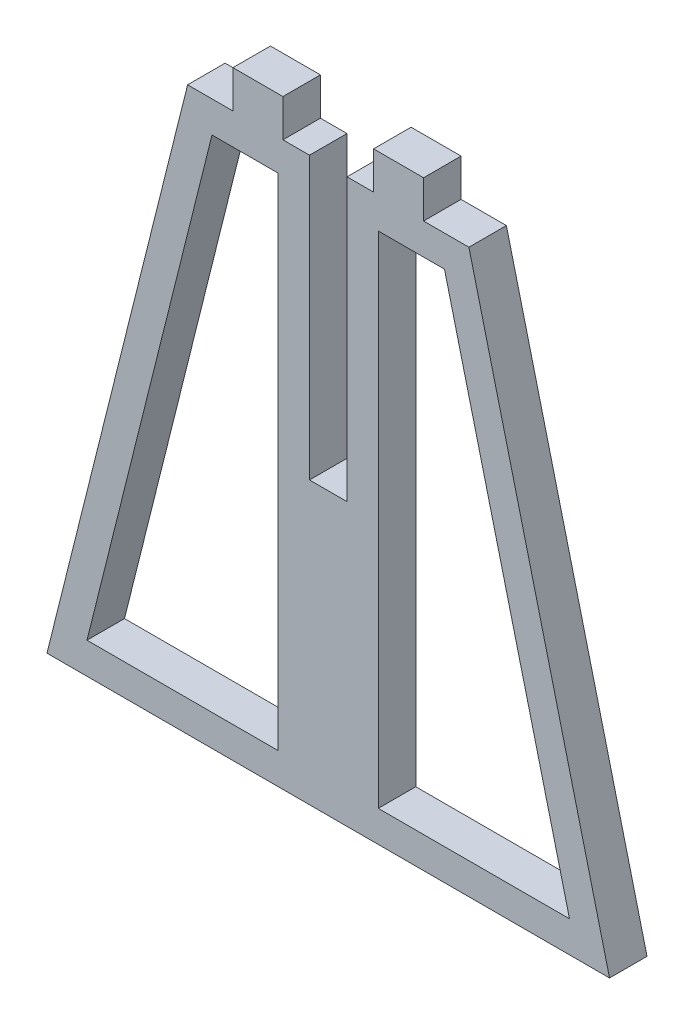
ISO-10303-21;
HEADER;
FILE_DESCRIPTION(('STEP AP214'),'2;1');
FILE_NAME('part.step','',(''),(''),'','','');
FILE_SCHEMA(('AUTOMOTIVE_DESIGN { 1 0 10303 214 1 1 1 1 }'));
ENDSEC;
DATA;
#1=APPLICATION_CONTEXT('core data for automotive mechanical design processes');
#2=APPLICATION_PROTOCOL_DEFINITION('international standard','automotive_design',2000,#1);
#3=PRODUCT_CONTEXT('',#1,'mechanical');
#4=PRODUCT('Part','Part','',(#3));
#5=PRODUCT_RELATED_PRODUCT_CATEGORY('part','',(#4));
#6=PRODUCT_DEFINITION_FORMATION('','',#4);
#7=PRODUCT_DEFINITION_CONTEXT('part definition',#1,'design');
#8=PRODUCT_DEFINITION('design','',#6,#7);
#9=PRODUCT_DEFINITION_SHAPE('','',#8);
#10=(LENGTH_UNIT() NAMED_UNIT(*) SI_UNIT(.MILLI.,.METRE.));
#11=(NAMED_UNIT(*) PLANE_ANGLE_UNIT() SI_UNIT($,.RADIAN.));
#12=(NAMED_UNIT(*) SI_UNIT($,.STERADIAN.) SOLID_ANGLE_UNIT());
#13=UNCERTAINTY_MEASURE_WITH_UNIT(LENGTH_MEASURE(1.E-05),#10,'distance_accuracy_value','');
#14=(GEOMETRIC_REPRESENTATION_CONTEXT(3) GLOBAL_UNCERTAINTY_ASSIGNED_CONTEXT((#13)) GLOBAL_UNIT_ASSIGNED_CONTEXT((#10,
#11,#12)) REPRESENTATION_CONTEXT('',''));
#15=CARTESIAN_POINT('',(0.,0.,0.));
#16=DIRECTION('',(0.,0.,1.));
#17=DIRECTION('',(1.,0.,0.));
#18=AXIS2_PLACEMENT_3D('',#15,#16,#17);
#19=CARTESIAN_POINT('',(0.,0.,6.));
#20=DIRECTION('',(0.,0.,-1.));
#21=DIRECTION('',(-1.,0.,0.));
#22=AXIS2_PLACEMENT_3D('',#19,#20,#21);
#23=PLANE('',#22);
#24=DIRECTION('',(0.,1.,0.));
#25=VECTOR('',#24,1.);
#26=CARTESIAN_POINT('',(-8.,20.6339866017632,6.));
#27=LINE('',#26,#25);
#28=CARTESIAN_POINT('',(-8.,20.6339866017632,6.));
#29=VERTEX_POINT('',#28);
#30=CARTESIAN_POINT('',(-8.,100.633986601763,6.));
#31=VERTEX_POINT('',#30);
#32=EDGE_CURVE('E230',#29,#31,#27,.T.);
#33=ORIENTED_EDGE('',*,*,#32,.F.);
#34=DIRECTION('',(1.,0.,0.));
#35=VECTOR('',#34,1.);
#36=CARTESIAN_POINT('',(-38.5961179679779,20.6339866017632,6.));
#37=LINE('',#36,#35);
#38=CARTESIAN_POINT('',(-38.5961179679779,20.6339866017632,6.));
#39=VERTEX_POINT('',#38);
#40=EDGE_CURVE('E238',#39,#29,#37,.T.);
#41=ORIENTED_EDGE('',*,*,#40,.F.);
#42=DIRECTION('',(-0.242535625036333,-0.970142500145332,0.));
#43=VECTOR('',#42,1.);
#44=CARTESIAN_POINT('',(-18.5961179679779,100.633986601763,6.));
#45=LINE('',#44,#43);
#46=CARTESIAN_POINT('',(-18.5961179679779,100.633986601763,6.));
#47=VERTEX_POINT('',#46);
#48=EDGE_CURVE('E235',#47,#39,#45,.T.);
#49=ORIENTED_EDGE('',*,*,#48,.F.);
#50=DIRECTION('',(-1.,0.,0.));
#51=VECTOR('',#50,1.);
#52=CARTESIAN_POINT('',(-8.,100.633986601763,6.));
#53=LINE('',#52,#51);
#54=EDGE_CURVE('E232',#31,#47,#53,.T.);
#55=ORIENTED_EDGE('',*,*,#54,.F.);
#56=EDGE_LOOP('',(#33,#41,#49,#55));
#57=FACE_BOUND('',#56,.T.);
#58=DIRECTION('',(-0.242535625036333,0.970142500145332,0.));
#59=VECTOR('',#58,1.);
#60=CARTESIAN_POINT('',(22.5,105.633986601763,6.));
#61=LINE('',#60,#59);
#62=CARTESIAN_POINT('',(45.,15.6339866017632,6.));
#63=VERTEX_POINT('',#62);
#64=CARTESIAN_POINT('',(22.5,105.633986601763,6.));
#65=VERTEX_POINT('',#64);
#66=EDGE_CURVE('E261',#63,#65,#61,.T.);
#67=ORIENTED_EDGE('',*,*,#66,.T.);
#68=DIRECTION('',(-1.,0.,0.));
#69=VECTOR('',#68,1.);
#70=CARTESIAN_POINT('',(15.25,105.633986601763,6.));
#71=LINE('',#70,#69);
#72=CARTESIAN_POINT('',(15.25,105.633986601763,6.));
#73=VERTEX_POINT('',#72);
#74=EDGE_CURVE('E264',#65,#73,#71,.T.);
#75=ORIENTED_EDGE('',*,*,#74,.T.);
#76=DIRECTION('',(0.,1.,0.));
#77=VECTOR('',#76,1.);
#78=CARTESIAN_POINT('',(15.25,105.633986601763,6.));
#79=LINE('',#78,#77);
#80=CARTESIAN_POINT('',(15.25,111.633986601763,6.));
#81=VERTEX_POINT('',#80);
#82=EDGE_CURVE('E267',#73,#81,#79,.T.);
#83=ORIENTED_EDGE('',*,*,#82,.T.);
#84=DIRECTION('',(-1.,0.,0.));
#85=VECTOR('',#84,1.);
#86=CARTESIAN_POINT('',(7.25,111.633986601763,6.));
#87=LINE('',#86,#85);
#88=CARTESIAN_POINT('',(7.25,111.633986601763,6.));
#89=VERTEX_POINT('',#88);
#90=EDGE_CURVE('E269',#81,#89,#87,.T.);
#91=ORIENTED_EDGE('',*,*,#90,.T.);
#92=DIRECTION('',(0.,-1.,0.));
#93=VECTOR('',#92,1.);
#94=CARTESIAN_POINT('',(7.25,105.633986601763,6.));
#95=LINE('',#94,#93);
#96=CARTESIAN_POINT('',(7.25,105.633986601763,6.));
#97=VERTEX_POINT('',#96);
#98=EDGE_CURVE('E271',#89,#97,#95,.T.);
#99=ORIENTED_EDGE('',*,*,#98,.T.);
#100=DIRECTION('',(-1.,0.,0.));
#101=VECTOR('',#100,1.);
#102=CARTESIAN_POINT('',(3.,105.633986601763,6.));
#103=LINE('',#102,#101);
#104=CARTESIAN_POINT('',(3.,105.633986601763,6.));
#105=VERTEX_POINT('',#104);
#106=EDGE_CURVE('E273',#97,#105,#103,.T.);
#107=ORIENTED_EDGE('',*,*,#106,.T.);
#108=DIRECTION('',(0.,-1.,0.));
#109=VECTOR('',#108,1.);
#110=CARTESIAN_POINT('',(3.,105.633986601763,6.));
#111=LINE('',#110,#109);
#112=CARTESIAN_POINT('',(3.,60.6339866017632,6.));
#113=VERTEX_POINT('',#112);
#114=EDGE_CURVE('E275',#105,#113,#111,.T.);
#115=ORIENTED_EDGE('',*,*,#114,.T.);
#116=DIRECTION('',(-1.,0.,0.));
#117=VECTOR('',#116,1.);
#118=CARTESIAN_POINT('',(-3.,60.6339866017632,6.));
#119=LINE('',#118,#117);
#120=CARTESIAN_POINT('',(-3.,60.6339866017632,6.));
#121=VERTEX_POINT('',#120);
#122=EDGE_CURVE('E277',#113,#121,#119,.T.);
#123=ORIENTED_EDGE('',*,*,#122,.T.);
#124=DIRECTION('',(0.,1.,0.));
#125=VECTOR('',#124,1.);
#126=CARTESIAN_POINT('',(-3.,105.633986601763,6.));
#127=LINE('',#126,#125);
#128=CARTESIAN_POINT('',(-3.,105.633986601763,6.));
#129=VERTEX_POINT('',#128);
#130=EDGE_CURVE('E279',#121,#129,#127,.T.);
#131=ORIENTED_EDGE('',*,*,#130,.T.);
#132=DIRECTION('',(-1.,0.,0.));
#133=VECTOR('',#132,1.);
#134=CARTESIAN_POINT('',(-7.25,105.633986601763,6.));
#135=LINE('',#134,#133);
#136=CARTESIAN_POINT('',(-7.25,105.633986601763,6.));
#137=VERTEX_POINT('',#136);
#138=EDGE_CURVE('E281',#129,#137,#135,.T.);
#139=ORIENTED_EDGE('',*,*,#138,.T.);
#140=DIRECTION('',(0.,1.,0.));
#141=VECTOR('',#140,1.);
#142=CARTESIAN_POINT('',(-7.25,105.633986601763,6.));
#143=LINE('',#142,#141);
#144=CARTESIAN_POINT('',(-7.25,111.633986601763,6.));
#145=VERTEX_POINT('',#144);
#146=EDGE_CURVE('E283',#137,#145,#143,.T.);
#147=ORIENTED_EDGE('',*,*,#146,.T.);
#148=DIRECTION('',(-1.,0.,0.));
#149=VECTOR('',#148,1.);
#150=CARTESIAN_POINT('',(-7.25,111.633986601763,6.));
#151=LINE('',#150,#149);
#152=CARTESIAN_POINT('',(-15.25,111.633986601763,6.));
#153=VERTEX_POINT('',#152);
#154=EDGE_CURVE('E285',#145,#153,#151,.T.);
#155=ORIENTED_EDGE('',*,*,#154,.T.);
#156=DIRECTION('',(0.,-1.,0.));
#157=VECTOR('',#156,1.);
#158=CARTESIAN_POINT('',(-15.25,105.633986601763,6.));
#159=LINE('',#158,#157);
#160=CARTESIAN_POINT('',(-15.25,105.633986601763,6.));
#161=VERTEX_POINT('',#160);
#162=EDGE_CURVE('E287',#153,#161,#159,.T.);
#163=ORIENTED_EDGE('',*,*,#162,.T.);
#164=DIRECTION('',(-1.,0.,0.));
#165=VECTOR('',#164,1.);
#166=CARTESIAN_POINT('',(-22.5,105.633986601763,6.));
#167=LINE('',#166,#165);
#168=CARTESIAN_POINT('',(-22.5,105.633986601763,6.));
#169=VERTEX_POINT('',#168);
#170=EDGE_CURVE('E289',#161,#169,#167,.T.);
#171=ORIENTED_EDGE('',*,*,#170,.T.);
#172=DIRECTION('',(-0.242535625036333,-0.970142500145332,0.));
#173=VECTOR('',#172,1.);
#174=CARTESIAN_POINT('',(-45.,15.6339866017632,6.));
#175=LINE('',#174,#173);
#176=CARTESIAN_POINT('',(-45.,15.6339866017632,6.));
#177=VERTEX_POINT('',#176);
#178=EDGE_CURVE('E291',#169,#177,#175,.T.);
#179=ORIENTED_EDGE('',*,*,#178,.T.);
#180=DIRECTION('',(1.,0.,0.));
#181=VECTOR('',#180,1.);
#182=CARTESIAN_POINT('',(45.,15.6339866017632,6.));
#183=LINE('',#182,#181);
#184=EDGE_CURVE('E293',#177,#63,#183,.T.);
#185=ORIENTED_EDGE('',*,*,#184,.T.);
#186=EDGE_LOOP('',(#67,#75,#83,#91,#99,#107,#115,#123,#131,#139,#147,#155,#163,#171,#179,#185));
#187=FACE_BOUND('',#186,.T.);
#188=DIRECTION('',(-0.242535625036333,0.970142500145332,0.));
#189=VECTOR('',#188,1.);
#190=CARTESIAN_POINT('',(18.5961179679779,100.633986601763,6.));
#191=LINE('',#190,#189);
#192=CARTESIAN_POINT('',(38.5961179679779,20.6339866017632,6.));
#193=VERTEX_POINT('',#192);
#194=CARTESIAN_POINT('',(18.5961179679779,100.633986601763,6.));
#195=VERTEX_POINT('',#194);
#196=EDGE_CURVE('E194',#193,#195,#191,.T.);
#197=ORIENTED_EDGE('',*,*,#196,.F.);
#198=DIRECTION('',(1.,0.,0.));
#199=VECTOR('',#198,1.);
#200=CARTESIAN_POINT('',(38.5961179679779,20.6339866017632,6.));
#201=LINE('',#200,#199);
#202=CARTESIAN_POINT('',(8.,20.6339866017632,6.));
#203=VERTEX_POINT('',#202);
#204=EDGE_CURVE('E216',#203,#193,#201,.T.);
#205=ORIENTED_EDGE('',*,*,#204,.F.);
#206=DIRECTION('',(0.,-1.,0.));
#207=VECTOR('',#206,1.);
#208=CARTESIAN_POINT('',(8.,20.6339866017632,6.));
#209=LINE('',#208,#207);
#210=CARTESIAN_POINT('',(8.,100.633986601763,6.));
#211=VERTEX_POINT('',#210);
#212=EDGE_CURVE('E214',#211,#203,#209,.T.);
#213=ORIENTED_EDGE('',*,*,#212,.F.);
#214=DIRECTION('',(-1.,0.,0.));
#215=VECTOR('',#214,1.);
#216=CARTESIAN_POINT('',(8.,100.633986601763,6.));
#217=LINE('',#216,#215);
#218=EDGE_CURVE('E202',#195,#211,#217,.T.);
#219=ORIENTED_EDGE('',*,*,#218,.F.);
#220=EDGE_LOOP('',(#197,#205,#213,#219));
#221=FACE_BOUND('',#220,.T.);
#222=ADVANCED_FACE('F33',(#57,#187,#221),#23,.F.);
#223=CARTESIAN_POINT('',(0.,0.,0.));
#224=DIRECTION('',(0.,0.,-1.));
#225=DIRECTION('',(-1.,0.,0.));
#226=AXIS2_PLACEMENT_3D('',#223,#224,#225);
#227=PLANE('',#226);
#228=DIRECTION('',(-0.242535625036333,0.970142500145332,0.));
#229=VECTOR('',#228,1.);
#230=CARTESIAN_POINT('',(22.5,105.633986601763,0.));
#231=LINE('',#230,#229);
#232=CARTESIAN_POINT('',(45.,15.6339866017632,0.));
#233=VERTEX_POINT('',#232);
#234=CARTESIAN_POINT('',(22.5,105.633986601763,0.));
#235=VERTEX_POINT('',#234);
#236=EDGE_CURVE('E260',#233,#235,#231,.T.);
#237=ORIENTED_EDGE('',*,*,#236,.F.);
#238=DIRECTION('',(1.,0.,0.));
#239=VECTOR('',#238,1.);
#240=CARTESIAN_POINT('',(45.,15.6339866017632,0.));
#241=LINE('',#240,#239);
#242=CARTESIAN_POINT('',(-45.,15.6339866017632,0.));
#243=VERTEX_POINT('',#242);
#244=EDGE_CURVE('E265',#243,#233,#241,.T.);
#245=ORIENTED_EDGE('',*,*,#244,.F.);
#246=DIRECTION('',(-0.242535625036333,-0.970142500145332,0.));
#247=VECTOR('',#246,1.);
#248=CARTESIAN_POINT('',(-45.,15.6339866017632,0.));
#249=LINE('',#248,#247);
#250=CARTESIAN_POINT('',(-22.5,105.633986601763,0.));
#251=VERTEX_POINT('',#250);
#252=EDGE_CURVE('E324',#251,#243,#249,.T.);
#253=ORIENTED_EDGE('',*,*,#252,.F.);
#254=DIRECTION('',(-1.,0.,0.));
#255=VECTOR('',#254,1.);
#256=CARTESIAN_POINT('',(-22.5,105.633986601763,0.));
#257=LINE('',#256,#255);
#258=CARTESIAN_POINT('',(-15.25,105.633986601763,0.));
#259=VERTEX_POINT('',#258);
#260=EDGE_CURVE('E322',#259,#251,#257,.T.);
#261=ORIENTED_EDGE('',*,*,#260,.F.);
#262=DIRECTION('',(0.,-1.,0.));
#263=VECTOR('',#262,1.);
#264=CARTESIAN_POINT('',(-15.25,105.633986601763,0.));
#265=LINE('',#264,#263);
#266=CARTESIAN_POINT('',(-15.25,111.633986601763,0.));
#267=VERTEX_POINT('',#266);
#268=EDGE_CURVE('E320',#267,#259,#265,.T.);
#269=ORIENTED_EDGE('',*,*,#268,.F.);
#270=DIRECTION('',(-1.,0.,0.));
#271=VECTOR('',#270,1.);
#272=CARTESIAN_POINT('',(-7.25,111.633986601763,0.));
#273=LINE('',#272,#271);
#274=CARTESIAN_POINT('',(-7.25,111.633986601763,0.));
#275=VERTEX_POINT('',#274);
#276=EDGE_CURVE('E318',#275,#267,#273,.T.);
#277=ORIENTED_EDGE('',*,*,#276,.F.);
#278=DIRECTION('',(0.,1.,0.));
#279=VECTOR('',#278,1.);
#280=CARTESIAN_POINT('',(-7.25,105.633986601763,0.));
#281=LINE('',#280,#279);
#282=CARTESIAN_POINT('',(-7.25,105.633986601763,0.));
#283=VERTEX_POINT('',#282);
#284=EDGE_CURVE('E316',#283,#275,#281,.T.);
#285=ORIENTED_EDGE('',*,*,#284,.F.);
#286=DIRECTION('',(-1.,0.,0.));
#287=VECTOR('',#286,1.);
#288=CARTESIAN_POINT('',(-7.25,105.633986601763,0.));
#289=LINE('',#288,#287);
#290=CARTESIAN_POINT('',(-3.,105.633986601763,0.));
#291=VERTEX_POINT('',#290);
#292=EDGE_CURVE('E314',#291,#283,#289,.T.);
#293=ORIENTED_EDGE('',*,*,#292,.F.);
#294=DIRECTION('',(0.,1.,0.));
#295=VECTOR('',#294,1.);
#296=CARTESIAN_POINT('',(-3.,105.633986601763,0.));
#297=LINE('',#296,#295);
#298=CARTESIAN_POINT('',(-3.,60.6339866017632,0.));
#299=VERTEX_POINT('',#298);
#300=EDGE_CURVE('E312',#299,#291,#297,.T.);
#301=ORIENTED_EDGE('',*,*,#300,.F.);
#302=DIRECTION('',(-1.,0.,0.));
#303=VECTOR('',#302,1.);
#304=CARTESIAN_POINT('',(-3.,60.6339866017632,0.));
#305=LINE('',#304,#303);
#306=CARTESIAN_POINT('',(3.,60.6339866017632,0.));
#307=VERTEX_POINT('',#306);
#308=EDGE_CURVE('E310',#307,#299,#305,.T.);
#309=ORIENTED_EDGE('',*,*,#308,.F.);
#310=DIRECTION('',(0.,-1.,0.));
#311=VECTOR('',#310,1.);
#312=CARTESIAN_POINT('',(3.,105.633986601763,0.));
#313=LINE('',#312,#311);
#314=CARTESIAN_POINT('',(3.,105.633986601763,0.));
#315=VERTEX_POINT('',#314);
#316=EDGE_CURVE('E308',#315,#307,#313,.T.);
#317=ORIENTED_EDGE('',*,*,#316,.F.);
#318=DIRECTION('',(-1.,0.,0.));
#319=VECTOR('',#318,1.);
#320=CARTESIAN_POINT('',(3.,105.633986601763,0.));
#321=LINE('',#320,#319);
#322=CARTESIAN_POINT('',(7.25,105.633986601763,0.));
#323=VERTEX_POINT('',#322);
#324=EDGE_CURVE('E306',#323,#315,#321,.T.);
#325=ORIENTED_EDGE('',*,*,#324,.F.);
#326=DIRECTION('',(0.,-1.,0.));
#327=VECTOR('',#326,1.);
#328=CARTESIAN_POINT('',(7.25,105.633986601763,0.));
#329=LINE('',#328,#327);
#330=CARTESIAN_POINT('',(7.25,111.633986601763,0.));
#331=VERTEX_POINT('',#330);
#332=EDGE_CURVE('E304',#331,#323,#329,.T.);
#333=ORIENTED_EDGE('',*,*,#332,.F.);
#334=DIRECTION('',(-1.,0.,0.));
#335=VECTOR('',#334,1.);
#336=CARTESIAN_POINT('',(7.25,111.633986601763,0.));
#337=LINE('',#336,#335);
#338=CARTESIAN_POINT('',(15.25,111.633986601763,0.));
#339=VERTEX_POINT('',#338);
#340=EDGE_CURVE('E302',#339,#331,#337,.T.);
#341=ORIENTED_EDGE('',*,*,#340,.F.);
#342=DIRECTION('',(0.,1.,0.));
#343=VECTOR('',#342,1.);
#344=CARTESIAN_POINT('',(15.25,105.633986601763,0.));
#345=LINE('',#344,#343);
#346=CARTESIAN_POINT('',(15.25,105.633986601763,0.));
#347=VERTEX_POINT('',#346);
#348=EDGE_CURVE('E300',#347,#339,#345,.T.);
#349=ORIENTED_EDGE('',*,*,#348,.F.);
#350=DIRECTION('',(-1.,0.,0.));
#351=VECTOR('',#350,1.);
#352=CARTESIAN_POINT('',(15.25,105.633986601763,0.));
#353=LINE('',#352,#351);
#354=EDGE_CURVE('E298',#235,#347,#353,.T.);
#355=ORIENTED_EDGE('',*,*,#354,.F.);
#356=EDGE_LOOP('',(#237,#245,#253,#261,#269,#277,#285,#293,#301,#309,#317,#325,#333,#341,#349,#355));
#357=FACE_BOUND('',#356,.T.);
#358=DIRECTION('',(1.,0.,0.));
#359=VECTOR('',#358,1.);
#360=CARTESIAN_POINT('',(-38.5961179679779,20.6339866017632,0.));
#361=LINE('',#360,#359);
#362=CARTESIAN_POINT('',(-38.5961179679779,20.6339866017632,0.));
#363=VERTEX_POINT('',#362);
#364=CARTESIAN_POINT('',(-8.,20.6339866017632,0.));
#365=VERTEX_POINT('',#364);
#366=EDGE_CURVE('E233',#363,#365,#361,.T.);
#367=ORIENTED_EDGE('',*,*,#366,.T.);
#368=DIRECTION('',(0.,1.,0.));
#369=VECTOR('',#368,1.);
#370=CARTESIAN_POINT('',(-8.,20.6339866017632,0.));
#371=LINE('',#370,#369);
#372=CARTESIAN_POINT('',(-8.,100.633986601763,0.));
#373=VERTEX_POINT('',#372);
#374=EDGE_CURVE('E210',#365,#373,#371,.T.);
#375=ORIENTED_EDGE('',*,*,#374,.T.);
#376=DIRECTION('',(-1.,0.,0.));
#377=VECTOR('',#376,1.);
#378=CARTESIAN_POINT('',(-8.,100.633986601763,0.));
#379=LINE('',#378,#377);
#380=CARTESIAN_POINT('',(-18.5961179679779,100.633986601763,0.));
#381=VERTEX_POINT('',#380);
#382=EDGE_CURVE('E243',#373,#381,#379,.T.);
#383=ORIENTED_EDGE('',*,*,#382,.T.);
#384=DIRECTION('',(-0.242535625036333,-0.970142500145332,0.));
#385=VECTOR('',#384,1.);
#386=CARTESIAN_POINT('',(-18.5961179679779,100.633986601763,0.));
#387=LINE('',#386,#385);
#388=EDGE_CURVE('E246',#381,#363,#387,.T.);
#389=ORIENTED_EDGE('',*,*,#388,.T.);
#390=EDGE_LOOP('',(#367,#375,#383,#389));
#391=FACE_BOUND('',#390,.T.);
#392=DIRECTION('',(1.,0.,0.));
#393=VECTOR('',#392,1.);
#394=CARTESIAN_POINT('',(38.5961179679779,20.6339866017632,0.));
#395=LINE('',#394,#393);
#396=CARTESIAN_POINT('',(8.,20.6339866017632,0.));
#397=VERTEX_POINT('',#396);
#398=CARTESIAN_POINT('',(38.5961179679779,20.6339866017632,0.));
#399=VERTEX_POINT('',#398);
#400=EDGE_CURVE('E203',#397,#399,#395,.T.);
#401=ORIENTED_EDGE('',*,*,#400,.T.);
#402=DIRECTION('',(-0.242535625036333,0.970142500145332,0.));
#403=VECTOR('',#402,1.);
#404=CARTESIAN_POINT('',(18.5961179679779,100.633986601763,0.));
#405=LINE('',#404,#403);
#406=CARTESIAN_POINT('',(18.5961179679779,100.633986601763,0.));
#407=VERTEX_POINT('',#406);
#408=EDGE_CURVE('E56',#399,#407,#405,.T.);
#409=ORIENTED_EDGE('',*,*,#408,.T.);
#410=DIRECTION('',(-1.,0.,0.));
#411=VECTOR('',#410,1.);
#412=CARTESIAN_POINT('',(8.,100.633986601763,0.));
#413=LINE('',#412,#411);
#414=CARTESIAN_POINT('',(8.,100.633986601763,0.));
#415=VERTEX_POINT('',#414);
#416=EDGE_CURVE('E209',#407,#415,#413,.T.);
#417=ORIENTED_EDGE('',*,*,#416,.T.);
#418=DIRECTION('',(0.,-1.,0.));
#419=VECTOR('',#418,1.);
#420=CARTESIAN_POINT('',(8.,20.6339866017632,0.));
#421=LINE('',#420,#419);
#422=EDGE_CURVE('E222',#415,#397,#421,.T.);
#423=ORIENTED_EDGE('',*,*,#422,.T.);
#424=EDGE_LOOP('',(#401,#409,#417,#423));
#425=FACE_BOUND('',#424,.T.);
#426=ADVANCED_FACE('F378',(#357,#391,#425),#227,.T.);
#427=CARTESIAN_POINT('',(22.5,105.633986601763,6.));
#428=DIRECTION('',(-0.970142500145332,-0.242535625036333,0.));
#429=DIRECTION('',(0.242535625036333,-0.970142500145332,0.));
#430=AXIS2_PLACEMENT_3D('',#427,#428,#429);
#431=PLANE('',#430);
#432=ORIENTED_EDGE('',*,*,#236,.T.);
#433=DIRECTION('',(0.,0.,-1.));
#434=VECTOR('',#433,1.);
#435=CARTESIAN_POINT('',(22.5,105.633986601763,6.));
#436=LINE('',#435,#434);
#437=EDGE_CURVE('E11',#65,#235,#436,.T.);
#438=ORIENTED_EDGE('',*,*,#437,.F.);
#439=ORIENTED_EDGE('',*,*,#66,.F.);
#440=DIRECTION('',(0.,0.,-1.));
#441=VECTOR('',#440,1.);
#442=CARTESIAN_POINT('',(45.,15.6339866017632,6.));
#443=LINE('',#442,#441);
#444=EDGE_CURVE('E295',#63,#233,#443,.T.);
#445=ORIENTED_EDGE('',*,*,#444,.T.);
#446=EDGE_LOOP('',(#432,#438,#439,#445));
#447=FACE_BOUND('',#446,.T.);
#448=ADVANCED_FACE('F35',(#447),#431,.F.);
#449=CARTESIAN_POINT('',(15.25,105.633986601763,6.));
#450=DIRECTION('',(0.,-1.,0.));
#451=DIRECTION('',(0.,0.,-1.));
#452=AXIS2_PLACEMENT_3D('',#449,#450,#451);
#453=PLANE('',#452);
#454=ORIENTED_EDGE('',*,*,#354,.T.);
#455=DIRECTION('',(0.,0.,-1.));
#456=VECTOR('',#455,1.);
#457=CARTESIAN_POINT('',(15.25,105.633986601763,6.));
#458=LINE('',#457,#456);
#459=EDGE_CURVE('E41',#73,#347,#458,.T.);
#460=ORIENTED_EDGE('',*,*,#459,.F.);
#461=ORIENTED_EDGE('',*,*,#74,.F.);
#462=ORIENTED_EDGE('',*,*,#437,.T.);
#463=EDGE_LOOP('',(#454,#460,#461,#462));
#464=FACE_BOUND('',#463,.T.);
#465=ADVANCED_FACE('F395',(#464),#453,.F.);
#466=CARTESIAN_POINT('',(15.25,105.633986601763,6.));
#467=DIRECTION('',(-1.,0.,0.));
#468=DIRECTION('',(0.,-1.,0.));
#469=AXIS2_PLACEMENT_3D('',#466,#467,#468);
#470=PLANE('',#469);
#471=ORIENTED_EDGE('',*,*,#348,.T.);
#472=DIRECTION('',(0.,0.,-1.));
#473=VECTOR('',#472,1.);
#474=CARTESIAN_POINT('',(15.25,111.633986601763,6.));
#475=LINE('',#474,#473);
#476=EDGE_CURVE('E365',#81,#339,#475,.T.);
#477=ORIENTED_EDGE('',*,*,#476,.F.);
#478=ORIENTED_EDGE('',*,*,#82,.F.);
#479=ORIENTED_EDGE('',*,*,#459,.T.);
#480=EDGE_LOOP('',(#471,#477,#478,#479));
#481=FACE_BOUND('',#480,.T.);
#482=ADVANCED_FACE('F372',(#481),#470,.F.);
#483=CARTESIAN_POINT('',(7.25,111.633986601763,6.));
#484=DIRECTION('',(0.,-1.,0.));
#485=DIRECTION('',(0.,0.,-1.));
#486=AXIS2_PLACEMENT_3D('',#483,#484,#485);
#487=PLANE('',#486);
#488=ORIENTED_EDGE('',*,*,#340,.T.);
#489=DIRECTION('',(0.,0.,-1.));
#490=VECTOR('',#489,1.);
#491=CARTESIAN_POINT('',(7.25,111.633986601763,6.));
#492=LINE('',#491,#490);
#493=EDGE_CURVE('E362',#89,#331,#492,.T.);
#494=ORIENTED_EDGE('',*,*,#493,.F.);
#495=ORIENTED_EDGE('',*,*,#90,.F.);
#496=ORIENTED_EDGE('',*,*,#476,.T.);
#497=EDGE_LOOP('',(#488,#494,#495,#496));
#498=FACE_BOUND('',#497,.T.);
#499=ADVANCED_FACE('F384',(#498),#487,.F.);
#500=CARTESIAN_POINT('',(7.25,105.633986601763,6.));
#501=DIRECTION('',(1.,0.,0.));
#502=DIRECTION('',(0.,1.,0.));
#503=AXIS2_PLACEMENT_3D('',#500,#501,#502);
#504=PLANE('',#503);
#505=ORIENTED_EDGE('',*,*,#332,.T.);
#506=DIRECTION('',(0.,0.,-1.));
#507=VECTOR('',#506,1.);
#508=CARTESIAN_POINT('',(7.25,105.633986601763,6.));
#509=LINE('',#508,#507);
#510=EDGE_CURVE('E359',#97,#323,#509,.T.);
#511=ORIENTED_EDGE('',*,*,#510,.F.);
#512=ORIENTED_EDGE('',*,*,#98,.F.);
#513=ORIENTED_EDGE('',*,*,#493,.T.);
#514=EDGE_LOOP('',(#505,#511,#512,#513));
#515=FACE_BOUND('',#514,.T.);
#516=ADVANCED_FACE('F388',(#515),#504,.F.);
#517=CARTESIAN_POINT('',(3.,105.633986601763,6.));
#518=DIRECTION('',(0.,-1.,0.));
#519=DIRECTION('',(0.,0.,-1.));
#520=AXIS2_PLACEMENT_3D('',#517,#518,#519);
#521=PLANE('',#520);
#522=ORIENTED_EDGE('',*,*,#324,.T.);
#523=DIRECTION('',(0.,0.,-1.));
#524=VECTOR('',#523,1.);
#525=CARTESIAN_POINT('',(3.,105.633986601763,6.));
#526=LINE('',#525,#524);
#527=EDGE_CURVE('E356',#105,#315,#526,.T.);
#528=ORIENTED_EDGE('',*,*,#527,.F.);
#529=ORIENTED_EDGE('',*,*,#106,.F.);
#530=ORIENTED_EDGE('',*,*,#510,.T.);
#531=EDGE_LOOP('',(#522,#528,#529,#530));
#532=FACE_BOUND('',#531,.T.);
#533=ADVANCED_FACE('F448',(#532),#521,.F.);
#534=CARTESIAN_POINT('',(3.,105.633986601763,6.));
#535=DIRECTION('',(1.,0.,0.));
#536=DIRECTION('',(0.,0.,-1.));
#537=AXIS2_PLACEMENT_3D('',#534,#535,#536);
#538=PLANE('',#537);
#539=ORIENTED_EDGE('',*,*,#316,.T.);
#540=DIRECTION('',(0.,0.,-1.));
#541=VECTOR('',#540,1.);
#542=CARTESIAN_POINT('',(3.,60.6339866017632,6.));
#543=LINE('',#542,#541);
#544=EDGE_CURVE('E353',#113,#307,#543,.T.);
#545=ORIENTED_EDGE('',*,*,#544,.F.);
#546=ORIENTED_EDGE('',*,*,#114,.F.);
#547=ORIENTED_EDGE('',*,*,#527,.T.);
#548=EDGE_LOOP('',(#539,#545,#546,#547));
#549=FACE_BOUND('',#548,.T.);
#550=ADVANCED_FACE('F445',(#549),#538,.F.);
#551=CARTESIAN_POINT('',(-3.,60.6339866017632,6.));
#552=DIRECTION('',(0.,-1.,0.));
#553=DIRECTION('',(0.,0.,-1.));
#554=AXIS2_PLACEMENT_3D('',#551,#552,#553);
#555=PLANE('',#554);
#556=ORIENTED_EDGE('',*,*,#308,.T.);
#557=DIRECTION('',(0.,0.,-1.));
#558=VECTOR('',#557,1.);
#559=CARTESIAN_POINT('',(-3.,60.6339866017632,6.));
#560=LINE('',#559,#558);
#561=EDGE_CURVE('E350',#121,#299,#560,.T.);
#562=ORIENTED_EDGE('',*,*,#561,.F.);
#563=ORIENTED_EDGE('',*,*,#122,.F.);
#564=ORIENTED_EDGE('',*,*,#544,.T.);
#565=EDGE_LOOP('',(#556,#562,#563,#564));
#566=FACE_BOUND('',#565,.T.);
#567=ADVANCED_FACE('F441',(#566),#555,.F.);
#568=CARTESIAN_POINT('',(-3.,105.633986601763,6.));
#569=DIRECTION('',(-1.,0.,0.));
#570=DIRECTION('',(0.,-1.,0.));
#571=AXIS2_PLACEMENT_3D('',#568,#569,#570);
#572=PLANE('',#571);
#573=ORIENTED_EDGE('',*,*,#300,.T.);
#574=DIRECTION('',(0.,0.,-1.));
#575=VECTOR('',#574,1.);
#576=CARTESIAN_POINT('',(-3.,105.633986601763,6.));
#577=LINE('',#576,#575);
#578=EDGE_CURVE('E347',#129,#291,#577,.T.);
#579=ORIENTED_EDGE('',*,*,#578,.F.);
#580=ORIENTED_EDGE('',*,*,#130,.F.);
#581=ORIENTED_EDGE('',*,*,#561,.T.);
#582=EDGE_LOOP('',(#573,#579,#580,#581));
#583=FACE_BOUND('',#582,.T.);
#584=ADVANCED_FACE('F437',(#583),#572,.F.);
#585=CARTESIAN_POINT('',(-7.25,105.633986601763,6.));
#586=DIRECTION('',(0.,-1.,0.));
#587=DIRECTION('',(0.,0.,-1.));
#588=AXIS2_PLACEMENT_3D('',#585,#586,#587);
#589=PLANE('',#588);
#590=ORIENTED_EDGE('',*,*,#292,.T.);
#591=DIRECTION('',(0.,0.,-1.));
#592=VECTOR('',#591,1.);
#593=CARTESIAN_POINT('',(-7.25,105.633986601763,6.));
#594=LINE('',#593,#592);
#595=EDGE_CURVE('E344',#137,#283,#594,.T.);
#596=ORIENTED_EDGE('',*,*,#595,.F.);
#597=ORIENTED_EDGE('',*,*,#138,.F.);
#598=ORIENTED_EDGE('',*,*,#578,.T.);
#599=EDGE_LOOP('',(#590,#596,#597,#598));
#600=FACE_BOUND('',#599,.T.);
#601=ADVANCED_FACE('F432',(#600),#589,.F.);
#602=CARTESIAN_POINT('',(-7.25,105.633986601763,6.));
#603=DIRECTION('',(-1.,0.,0.));
#604=DIRECTION('',(0.,-1.,0.));
#605=AXIS2_PLACEMENT_3D('',#602,#603,#604);
#606=PLANE('',#605);
#607=ORIENTED_EDGE('',*,*,#284,.T.);
#608=DIRECTION('',(0.,0.,-1.));
#609=VECTOR('',#608,1.);
#610=CARTESIAN_POINT('',(-7.25,111.633986601763,6.));
#611=LINE('',#610,#609);
#612=EDGE_CURVE('E341',#145,#275,#611,.T.);
#613=ORIENTED_EDGE('',*,*,#612,.F.);
#614=ORIENTED_EDGE('',*,*,#146,.F.);
#615=ORIENTED_EDGE('',*,*,#595,.T.);
#616=EDGE_LOOP('',(#607,#613,#614,#615));
#617=FACE_BOUND('',#616,.T.);
#618=ADVANCED_FACE('F426',(#617),#606,.F.);
#619=CARTESIAN_POINT('',(-7.25,111.633986601763,6.));
#620=DIRECTION('',(0.,-1.,0.));
#621=DIRECTION('',(0.,0.,-1.));
#622=AXIS2_PLACEMENT_3D('',#619,#620,#621);
#623=PLANE('',#622);
#624=ORIENTED_EDGE('',*,*,#276,.T.);
#625=DIRECTION('',(0.,0.,-1.));
#626=VECTOR('',#625,1.);
#627=CARTESIAN_POINT('',(-15.25,111.633986601763,6.));
#628=LINE('',#627,#626);
#629=EDGE_CURVE('E338',#153,#267,#628,.T.);
#630=ORIENTED_EDGE('',*,*,#629,.F.);
#631=ORIENTED_EDGE('',*,*,#154,.F.);
#632=ORIENTED_EDGE('',*,*,#612,.T.);
#633=EDGE_LOOP('',(#624,#630,#631,#632));
#634=FACE_BOUND('',#633,.T.);
#635=ADVANCED_FACE('F422',(#634),#623,.F.);
#636=CARTESIAN_POINT('',(-15.25,105.633986601763,6.));
#637=DIRECTION('',(1.,0.,0.));
#638=DIRECTION('',(0.,0.,-1.));
#639=AXIS2_PLACEMENT_3D('',#636,#637,#638);
#640=PLANE('',#639);
#641=ORIENTED_EDGE('',*,*,#268,.T.);
#642=DIRECTION('',(0.,0.,-1.));
#643=VECTOR('',#642,1.);
#644=CARTESIAN_POINT('',(-15.25,105.633986601763,6.));
#645=LINE('',#644,#643);
#646=EDGE_CURVE('E335',#161,#259,#645,.T.);
#647=ORIENTED_EDGE('',*,*,#646,.F.);
#648=ORIENTED_EDGE('',*,*,#162,.F.);
#649=ORIENTED_EDGE('',*,*,#629,.T.);
#650=EDGE_LOOP('',(#641,#647,#648,#649));
#651=FACE_BOUND('',#650,.T.);
#652=ADVANCED_FACE('F417',(#651),#640,.F.);
#653=CARTESIAN_POINT('',(-22.5,105.633986601763,6.));
#654=DIRECTION('',(0.,-1.,0.));
#655=DIRECTION('',(0.,0.,-1.));
#656=AXIS2_PLACEMENT_3D('',#653,#654,#655);
#657=PLANE('',#656);
#658=ORIENTED_EDGE('',*,*,#260,.T.);
#659=DIRECTION('',(0.,0.,-1.));
#660=VECTOR('',#659,1.);
#661=CARTESIAN_POINT('',(-22.5,105.633986601763,6.));
#662=LINE('',#661,#660);
#663=EDGE_CURVE('E332',#169,#251,#662,.T.);
#664=ORIENTED_EDGE('',*,*,#663,.F.);
#665=ORIENTED_EDGE('',*,*,#170,.F.);
#666=ORIENTED_EDGE('',*,*,#646,.T.);
#667=EDGE_LOOP('',(#658,#664,#665,#666));
#668=FACE_BOUND('',#667,.T.);
#669=ADVANCED_FACE('F411',(#668),#657,.F.);
#670=CARTESIAN_POINT('',(-45.,15.6339866017632,6.));
#671=DIRECTION('',(0.970142500145332,-0.242535625036333,0.));
#672=DIRECTION('',(0.242535625036333,0.970142500145332,0.));
#673=AXIS2_PLACEMENT_3D('',#670,#671,#672);
#674=PLANE('',#673);
#675=ORIENTED_EDGE('',*,*,#252,.T.);
#676=DIRECTION('',(0.,0.,-1.));
#677=VECTOR('',#676,1.);
#678=CARTESIAN_POINT('',(-45.,15.6339866017632,6.));
#679=LINE('',#678,#677);
#680=EDGE_CURVE('E329',#177,#243,#679,.T.);
#681=ORIENTED_EDGE('',*,*,#680,.F.);
#682=ORIENTED_EDGE('',*,*,#178,.F.);
#683=ORIENTED_EDGE('',*,*,#663,.T.);
#684=EDGE_LOOP('',(#675,#681,#682,#683));
#685=FACE_BOUND('',#684,.T.);
#686=ADVANCED_FACE('F407',(#685),#674,.F.);
#687=CARTESIAN_POINT('',(45.,15.6339866017632,6.));
#688=DIRECTION('',(0.,1.,0.));
#689=DIRECTION('',(-1.,0.,0.));
#690=AXIS2_PLACEMENT_3D('',#687,#688,#689);
#691=PLANE('',#690);
#692=ORIENTED_EDGE('',*,*,#244,.T.);
#693=ORIENTED_EDGE('',*,*,#444,.F.);
#694=ORIENTED_EDGE('',*,*,#184,.F.);
#695=ORIENTED_EDGE('',*,*,#680,.T.);
#696=EDGE_LOOP('',(#692,#693,#694,#695));
#697=FACE_BOUND('',#696,.T.);
#698=ADVANCED_FACE('F402',(#697),#691,.F.);
#699=CARTESIAN_POINT('',(-8.,20.6339866017632,6.));
#700=DIRECTION('',(-1.,0.,0.));
#701=DIRECTION('',(0.,0.,1.));
#702=AXIS2_PLACEMENT_3D('',#699,#700,#701);
#703=PLANE('',#702);
#704=ORIENTED_EDGE('',*,*,#374,.F.);
#705=DIRECTION('',(0.,0.,-1.));
#706=VECTOR('',#705,1.);
#707=CARTESIAN_POINT('',(-8.,20.6339866017632,6.));
#708=LINE('',#707,#706);
#709=EDGE_CURVE('E240',#29,#365,#708,.T.);
#710=ORIENTED_EDGE('',*,*,#709,.F.);
#711=ORIENTED_EDGE('',*,*,#32,.T.);
#712=DIRECTION('',(0.,0.,-1.));
#713=VECTOR('',#712,1.);
#714=CARTESIAN_POINT('',(-8.,100.633986601763,6.));
#715=LINE('',#714,#713);
#716=EDGE_CURVE('E257',#31,#373,#715,.T.);
#717=ORIENTED_EDGE('',*,*,#716,.T.);
#718=EDGE_LOOP('',(#704,#710,#711,#717));
#719=FACE_BOUND('',#718,.T.);
#720=ADVANCED_FACE('F466',(#719),#703,.T.);
#721=CARTESIAN_POINT('',(-8.,100.633986601763,6.));
#722=DIRECTION('',(0.,-1.,0.));
#723=DIRECTION('',(0.,0.,-1.));
#724=AXIS2_PLACEMENT_3D('',#721,#722,#723);
#725=PLANE('',#724);
#726=ORIENTED_EDGE('',*,*,#382,.F.);
#727=ORIENTED_EDGE('',*,*,#716,.F.);
#728=ORIENTED_EDGE('',*,*,#54,.T.);
#729=DIRECTION('',(0.,0.,-1.));
#730=VECTOR('',#729,1.);
#731=CARTESIAN_POINT('',(-18.5961179679779,100.633986601763,6.));
#732=LINE('',#731,#730);
#733=EDGE_CURVE('E255',#47,#381,#732,.T.);
#734=ORIENTED_EDGE('',*,*,#733,.T.);
#735=EDGE_LOOP('',(#726,#727,#728,#734));
#736=FACE_BOUND('',#735,.T.);
#737=ADVANCED_FACE('F528',(#736),#725,.T.);
#738=CARTESIAN_POINT('',(-18.5961179679779,100.633986601763,6.));
#739=DIRECTION('',(0.970142500145332,-0.242535625036333,0.));
#740=DIRECTION('',(0.242535625036333,0.970142500145332,0.));
#741=AXIS2_PLACEMENT_3D('',#738,#739,#740);
#742=PLANE('',#741);
#743=ORIENTED_EDGE('',*,*,#388,.F.);
#744=ORIENTED_EDGE('',*,*,#733,.F.);
#745=ORIENTED_EDGE('',*,*,#48,.T.);
#746=DIRECTION('',(0.,0.,-1.));
#747=VECTOR('',#746,1.);
#748=CARTESIAN_POINT('',(-38.5961179679779,20.6339866017632,6.));
#749=LINE('',#748,#747);
#750=EDGE_CURVE('E253',#39,#363,#749,.T.);
#751=ORIENTED_EDGE('',*,*,#750,.T.);
#752=EDGE_LOOP('',(#743,#744,#745,#751));
#753=FACE_BOUND('',#752,.T.);
#754=ADVANCED_FACE('F535',(#753),#742,.T.);
#755=CARTESIAN_POINT('',(-38.5961179679779,20.6339866017632,6.));
#756=DIRECTION('',(0.,1.,0.));
#757=DIRECTION('',(0.,0.,1.));
#758=AXIS2_PLACEMENT_3D('',#755,#756,#757);
#759=PLANE('',#758);
#760=ORIENTED_EDGE('',*,*,#366,.F.);
#761=ORIENTED_EDGE('',*,*,#750,.F.);
#762=ORIENTED_EDGE('',*,*,#40,.T.);
#763=ORIENTED_EDGE('',*,*,#709,.T.);
#764=EDGE_LOOP('',(#760,#761,#762,#763));
#765=FACE_BOUND('',#764,.T.);
#766=ADVANCED_FACE('F542',(#765),#759,.T.);
#767=CARTESIAN_POINT('',(18.5961179679779,100.633986601763,6.));
#768=DIRECTION('',(-0.970142500145332,-0.242535625036333,0.));
#769=DIRECTION('',(0.242535625036333,-0.970142500145332,0.));
#770=AXIS2_PLACEMENT_3D('',#767,#768,#769);
#771=PLANE('',#770);
#772=ORIENTED_EDGE('',*,*,#408,.F.);
#773=DIRECTION('',(0.,0.,-1.));
#774=VECTOR('',#773,1.);
#775=CARTESIAN_POINT('',(38.5961179679779,20.6339866017632,6.));
#776=LINE('',#775,#774);
#777=EDGE_CURVE('E198',#193,#399,#776,.T.);
#778=ORIENTED_EDGE('',*,*,#777,.F.);
#779=ORIENTED_EDGE('',*,*,#196,.T.);
#780=DIRECTION('',(0.,0.,-1.));
#781=VECTOR('',#780,1.);
#782=CARTESIAN_POINT('',(18.5961179679779,100.633986601763,6.));
#783=LINE('',#782,#781);
#784=EDGE_CURVE('E197',#195,#407,#783,.T.);
#785=ORIENTED_EDGE('',*,*,#784,.T.);
#786=EDGE_LOOP('',(#772,#778,#779,#785));
#787=FACE_BOUND('',#786,.T.);
#788=ADVANCED_FACE('F196',(#787),#771,.T.);
#789=CARTESIAN_POINT('',(8.,100.633986601763,6.));
#790=DIRECTION('',(0.,-1.,0.));
#791=DIRECTION('',(0.,0.,-1.));
#792=AXIS2_PLACEMENT_3D('',#789,#790,#791);
#793=PLANE('',#792);
#794=ORIENTED_EDGE('',*,*,#416,.F.);
#795=ORIENTED_EDGE('',*,*,#784,.F.);
#796=ORIENTED_EDGE('',*,*,#218,.T.);
#797=DIRECTION('',(0.,0.,-1.));
#798=VECTOR('',#797,1.);
#799=CARTESIAN_POINT('',(8.,100.633986601763,6.));
#800=LINE('',#799,#798);
#801=EDGE_CURVE('E211',#211,#415,#800,.T.);
#802=ORIENTED_EDGE('',*,*,#801,.T.);
#803=EDGE_LOOP('',(#794,#795,#796,#802));
#804=FACE_BOUND('',#803,.T.);
#805=ADVANCED_FACE('F206',(#804),#793,.T.);
#806=CARTESIAN_POINT('',(8.,20.6339866017632,6.));
#807=DIRECTION('',(1.,0.,0.));
#808=DIRECTION('',(0.,0.,-1.));
#809=AXIS2_PLACEMENT_3D('',#806,#807,#808);
#810=PLANE('',#809);
#811=ORIENTED_EDGE('',*,*,#422,.F.);
#812=ORIENTED_EDGE('',*,*,#801,.F.);
#813=ORIENTED_EDGE('',*,*,#212,.T.);
#814=DIRECTION('',(0.,0.,-1.));
#815=VECTOR('',#814,1.);
#816=CARTESIAN_POINT('',(8.,20.6339866017632,6.));
#817=LINE('',#816,#815);
#818=EDGE_CURVE('E48',#203,#397,#817,.T.);
#819=ORIENTED_EDGE('',*,*,#818,.T.);
#820=EDGE_LOOP('',(#811,#812,#813,#819));
#821=FACE_BOUND('',#820,.T.);
#822=ADVANCED_FACE('F563',(#821),#810,.T.);
#823=CARTESIAN_POINT('',(38.5961179679779,20.6339866017632,6.));
#824=DIRECTION('',(0.,1.,0.));
#825=DIRECTION('',(0.,0.,1.));
#826=AXIS2_PLACEMENT_3D('',#823,#824,#825);
#827=PLANE('',#826);
#828=ORIENTED_EDGE('',*,*,#400,.F.);
#829=ORIENTED_EDGE('',*,*,#818,.F.);
#830=ORIENTED_EDGE('',*,*,#204,.T.);
#831=ORIENTED_EDGE('',*,*,#777,.T.);
#832=EDGE_LOOP('',(#828,#829,#830,#831));
#833=FACE_BOUND('',#832,.T.);
#834=ADVANCED_FACE('F570',(#833),#827,.T.);
#835=CLOSED_SHELL('',(#222,#426,#448,#465,#482,#499,#516,#533,#550,#567,#584,#601,#618,#635,
#652,#669,#686,#698,#720,#737,#754,#766,#788,#805,#822,#834));
#836=MANIFOLD_SOLID_BREP('B2',#835);
#837=ADVANCED_BREP_SHAPE_REPRESENTATION('',(#18,#836),#14);
#838=SHAPE_DEFINITION_REPRESENTATION(#9,#837);
ENDSEC;
END-ISO-10303-21;
